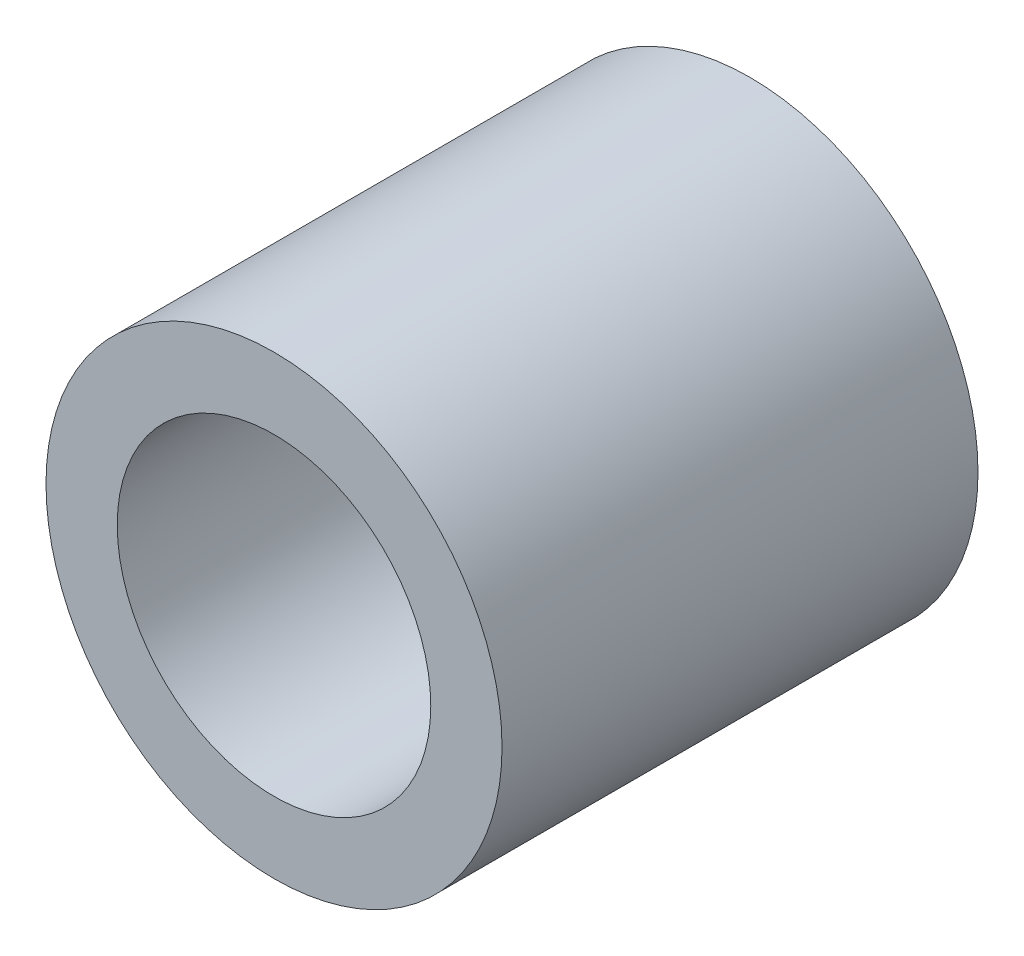
ISO-10303-21;
HEADER;
FILE_DESCRIPTION(('STEP AP214'),'2;1');
FILE_NAME('part.step','',(''),(''),'','','');
FILE_SCHEMA(('AUTOMOTIVE_DESIGN { 1 0 10303 214 1 1 1 1 }'));
ENDSEC;
DATA;
#1=APPLICATION_CONTEXT('core data for automotive mechanical design processes');
#2=APPLICATION_PROTOCOL_DEFINITION('international standard','automotive_design',2000,#1);
#3=PRODUCT_CONTEXT('',#1,'mechanical');
#4=PRODUCT('Part','Part','',(#3));
#5=PRODUCT_RELATED_PRODUCT_CATEGORY('part','',(#4));
#6=PRODUCT_DEFINITION_FORMATION('','',#4);
#7=PRODUCT_DEFINITION_CONTEXT('part definition',#1,'design');
#8=PRODUCT_DEFINITION('design','',#6,#7);
#9=PRODUCT_DEFINITION_SHAPE('','',#8);
#10=(LENGTH_UNIT() NAMED_UNIT(*) SI_UNIT(.MILLI.,.METRE.));
#11=(NAMED_UNIT(*) PLANE_ANGLE_UNIT() SI_UNIT($,.RADIAN.));
#12=(NAMED_UNIT(*) SI_UNIT($,.STERADIAN.) SOLID_ANGLE_UNIT());
#13=UNCERTAINTY_MEASURE_WITH_UNIT(LENGTH_MEASURE(1.E-05),#10,'distance_accuracy_value','');
#14=(GEOMETRIC_REPRESENTATION_CONTEXT(3) GLOBAL_UNCERTAINTY_ASSIGNED_CONTEXT((#13)) GLOBAL_UNIT_ASSIGNED_CONTEXT((#10,
#11,#12)) REPRESENTATION_CONTEXT('',''));
#15=CARTESIAN_POINT('',(0.,0.,0.));
#16=DIRECTION('',(0.,0.,1.));
#17=DIRECTION('',(1.,0.,0.));
#18=AXIS2_PLACEMENT_3D('',#15,#16,#17);
#19=CARTESIAN_POINT('',(0.,0.,0.));
#20=DIRECTION('',(0.,0.,1.));
#21=DIRECTION('',(1.,0.,0.));
#22=AXIS2_PLACEMENT_3D('',#19,#20,#21);
#23=CYLINDRICAL_SURFACE('',#22,2.75);
#24=CARTESIAN_POINT('',(0.,0.,8.35));
#25=DIRECTION('',(0.,0.,1.));
#26=DIRECTION('',(1.,0.,0.));
#27=AXIS2_PLACEMENT_3D('',#24,#25,#26);
#28=CIRCLE('',#27,2.75);
#29=CARTESIAN_POINT('',(2.75,0.,8.35));
#30=VERTEX_POINT('',#29);
#31=EDGE_CURVE('E18',#30,#30,#28,.F.);
#32=ORIENTED_EDGE('',*,*,#31,.F.);
#33=EDGE_LOOP('',(#32));
#34=FACE_BOUND('',#33,.T.);
#35=CARTESIAN_POINT('',(0.,0.,0.));
#36=DIRECTION('',(0.,0.,1.));
#37=DIRECTION('',(1.,0.,0.));
#38=AXIS2_PLACEMENT_3D('',#35,#36,#37);
#39=CIRCLE('',#38,2.75);
#40=CARTESIAN_POINT('',(2.75,0.,0.));
#41=VERTEX_POINT('',#40);
#42=EDGE_CURVE('E27',#41,#41,#39,.F.);
#43=ORIENTED_EDGE('',*,*,#42,.T.);
#44=EDGE_LOOP('',(#43));
#45=FACE_BOUND('',#44,.T.);
#46=ADVANCED_FACE('F15',(#34,#45),#23,.F.);
#47=CARTESIAN_POINT('',(0.,0.,8.35));
#48=DIRECTION('',(0.,0.,1.));
#49=DIRECTION('',(1.,0.,0.));
#50=AXIS2_PLACEMENT_3D('',#47,#48,#49);
#51=PLANE('',#50);
#52=ORIENTED_EDGE('',*,*,#31,.T.);
#53=EDGE_LOOP('',(#52));
#54=FACE_BOUND('',#53,.T.);
#55=CARTESIAN_POINT('',(0.,0.,8.35));
#56=DIRECTION('',(0.,0.,1.));
#57=DIRECTION('',(1.,0.,0.));
#58=AXIS2_PLACEMENT_3D('',#55,#56,#57);
#59=CIRCLE('',#58,4.);
#60=CARTESIAN_POINT('',(4.,0.,8.35));
#61=VERTEX_POINT('',#60);
#62=EDGE_CURVE('E22',#61,#61,#59,.F.);
#63=ORIENTED_EDGE('',*,*,#62,.F.);
#64=EDGE_LOOP('',(#63));
#65=FACE_BOUND('',#64,.T.);
#66=ADVANCED_FACE('F35',(#54,#65),#51,.T.);
#67=CARTESIAN_POINT('',(0.,0.,0.));
#68=DIRECTION('',(0.,0.,1.));
#69=DIRECTION('',(1.,0.,0.));
#70=AXIS2_PLACEMENT_3D('',#67,#68,#69);
#71=PLANE('',#70);
#72=ORIENTED_EDGE('',*,*,#42,.F.);
#73=EDGE_LOOP('',(#72));
#74=FACE_BOUND('',#73,.T.);
#75=CARTESIAN_POINT('',(0.,0.,0.));
#76=DIRECTION('',(0.,0.,1.));
#77=DIRECTION('',(1.,0.,0.));
#78=AXIS2_PLACEMENT_3D('',#75,#76,#77);
#79=CIRCLE('',#78,4.);
#80=CARTESIAN_POINT('',(4.,0.,0.));
#81=VERTEX_POINT('',#80);
#82=EDGE_CURVE('E10',#81,#81,#79,.T.);
#83=ORIENTED_EDGE('',*,*,#82,.F.);
#84=EDGE_LOOP('',(#83));
#85=FACE_BOUND('',#84,.T.);
#86=ADVANCED_FACE('F43',(#74,#85),#71,.F.);
#87=CARTESIAN_POINT('',(0.,0.,0.));
#88=DIRECTION('',(0.,0.,1.));
#89=DIRECTION('',(1.,0.,0.));
#90=AXIS2_PLACEMENT_3D('',#87,#88,#89);
#91=CYLINDRICAL_SURFACE('',#90,4.);
#92=ORIENTED_EDGE('',*,*,#62,.T.);
#93=EDGE_LOOP('',(#92));
#94=FACE_BOUND('',#93,.T.);
#95=ORIENTED_EDGE('',*,*,#82,.T.);
#96=EDGE_LOOP('',(#95));
#97=FACE_BOUND('',#96,.T.);
#98=ADVANCED_FACE('F44',(#94,#97),#91,.T.);
#99=CLOSED_SHELL('',(#46,#66,#86,#98));
#100=MANIFOLD_SOLID_BREP('B1',#99);
#101=ADVANCED_BREP_SHAPE_REPRESENTATION('',(#18,#100),#14);
#102=SHAPE_DEFINITION_REPRESENTATION(#9,#101);
ENDSEC;
END-ISO-10303-21;
